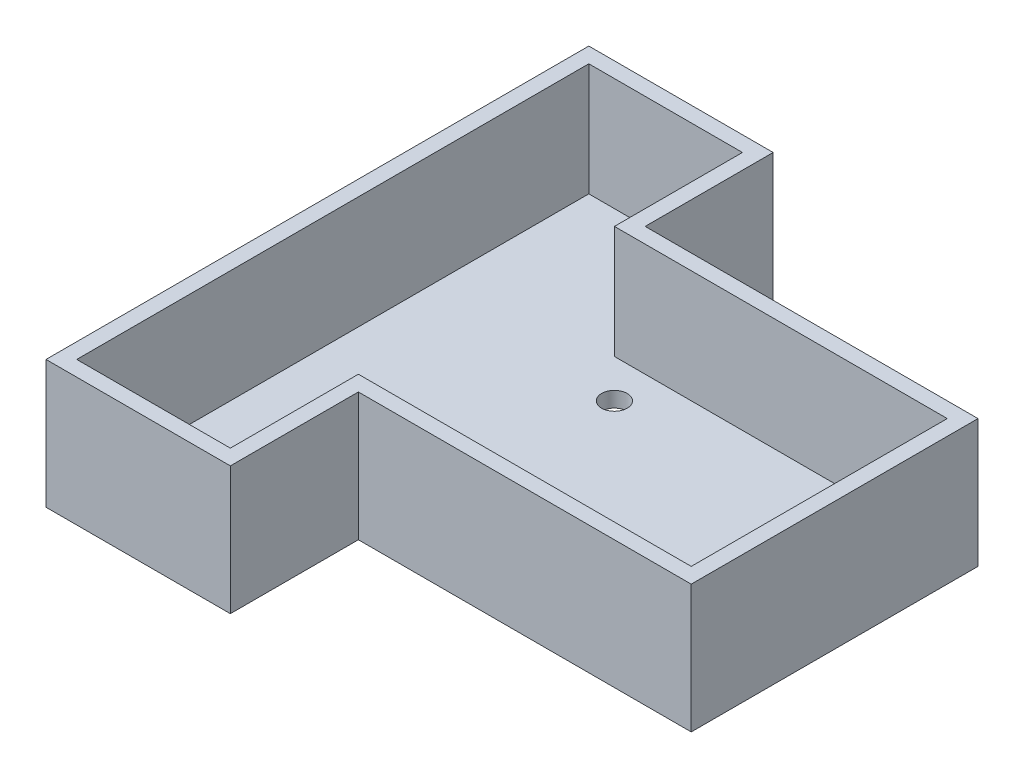
ISO-10303-21;
HEADER;
FILE_DESCRIPTION(('STEP AP214'),'2;1');
FILE_NAME('part.step','',(''),(''),'','','');
FILE_SCHEMA(('AUTOMOTIVE_DESIGN { 1 0 10303 214 1 1 1 1 }'));
ENDSEC;
DATA;
#1=APPLICATION_CONTEXT('core data for automotive mechanical design processes');
#2=APPLICATION_PROTOCOL_DEFINITION('international standard','automotive_design',2000,#1);
#3=PRODUCT_CONTEXT('',#1,'mechanical');
#4=PRODUCT('Part','Part','',(#3));
#5=PRODUCT_RELATED_PRODUCT_CATEGORY('part','',(#4));
#6=PRODUCT_DEFINITION_FORMATION('','',#4);
#7=PRODUCT_DEFINITION_CONTEXT('part definition',#1,'design');
#8=PRODUCT_DEFINITION('design','',#6,#7);
#9=PRODUCT_DEFINITION_SHAPE('','',#8);
#10=(LENGTH_UNIT() NAMED_UNIT(*) SI_UNIT(.MILLI.,.METRE.));
#11=(NAMED_UNIT(*) PLANE_ANGLE_UNIT() SI_UNIT($,.RADIAN.));
#12=(NAMED_UNIT(*) SI_UNIT($,.STERADIAN.) SOLID_ANGLE_UNIT());
#13=UNCERTAINTY_MEASURE_WITH_UNIT(LENGTH_MEASURE(1.E-05),#10,'distance_accuracy_value','');
#14=(GEOMETRIC_REPRESENTATION_CONTEXT(3) GLOBAL_UNCERTAINTY_ASSIGNED_CONTEXT((#13)) GLOBAL_UNIT_ASSIGNED_CONTEXT((#10,
#11,#12)) REPRESENTATION_CONTEXT('',''));
#15=CARTESIAN_POINT('',(0.,0.,0.));
#16=DIRECTION('',(0.,0.,1.));
#17=DIRECTION('',(1.,0.,0.));
#18=AXIS2_PLACEMENT_3D('',#15,#16,#17);
#19=CARTESIAN_POINT('',(-29.4999999999999,25.,0.));
#20=DIRECTION('',(1.,0.,0.));
#21=DIRECTION('',(0.,0.,-1.));
#22=AXIS2_PLACEMENT_3D('',#19,#20,#21);
#23=PLANE('',#22);
#24=DIRECTION('',(0.,0.,1.));
#25=VECTOR('',#24,1.);
#26=CARTESIAN_POINT('',(-29.4999999999999,0.,0.));
#27=LINE('',#26,#25);
#28=CARTESIAN_POINT('',(-29.4999999999999,0.,-53.));
#29=VERTEX_POINT('',#28);
#30=CARTESIAN_POINT('',(-29.4999999999999,0.,-28.));
#31=VERTEX_POINT('',#30);
#32=EDGE_CURVE('E157',#29,#31,#27,.T.);
#33=ORIENTED_EDGE('',*,*,#32,.F.);
#34=DIRECTION('',(0.,-1.,0.));
#35=VECTOR('',#34,1.);
#36=CARTESIAN_POINT('',(-29.4999999999999,25.,-53.));
#37=LINE('',#36,#35);
#38=CARTESIAN_POINT('',(-29.4999999999999,25.,-53.));
#39=VERTEX_POINT('',#38);
#40=EDGE_CURVE('E11',#39,#29,#37,.T.);
#41=ORIENTED_EDGE('',*,*,#40,.F.);
#42=DIRECTION('',(0.,0.,1.));
#43=VECTOR('',#42,1.);
#44=CARTESIAN_POINT('',(-29.4999999999999,25.,0.));
#45=LINE('',#44,#43);
#46=CARTESIAN_POINT('',(-29.4999999999999,25.,-28.));
#47=VERTEX_POINT('',#46);
#48=EDGE_CURVE('E200',#39,#47,#45,.T.);
#49=ORIENTED_EDGE('',*,*,#48,.T.);
#50=DIRECTION('',(0.,-1.,0.));
#51=VECTOR('',#50,1.);
#52=CARTESIAN_POINT('',(-29.4999999999999,25.,-28.));
#53=LINE('',#52,#51);
#54=EDGE_CURVE('E70',#47,#31,#53,.T.);
#55=ORIENTED_EDGE('',*,*,#54,.T.);
#56=EDGE_LOOP('',(#33,#41,#49,#55));
#57=FACE_BOUND('',#56,.T.);
#58=ADVANCED_FACE('F45',(#57),#23,.T.);
#59=CARTESIAN_POINT('',(0.,25.,-53.));
#60=DIRECTION('',(0.,0.,1.));
#61=DIRECTION('',(1.,0.,0.));
#62=AXIS2_PLACEMENT_3D('',#59,#60,#61);
#63=PLANE('',#62);
#64=DIRECTION('',(-1.,0.,0.));
#65=VECTOR('',#64,1.);
#66=CARTESIAN_POINT('',(0.,0.,-53.));
#67=LINE('',#66,#65);
#68=CARTESIAN_POINT('',(-65.5,0.,-53.));
#69=VERTEX_POINT('',#68);
#70=EDGE_CURVE('E160',#29,#69,#67,.T.);
#71=ORIENTED_EDGE('',*,*,#70,.T.);
#72=DIRECTION('',(0.,-1.,0.));
#73=VECTOR('',#72,1.);
#74=CARTESIAN_POINT('',(-65.5,25.,-53.));
#75=LINE('',#74,#73);
#76=CARTESIAN_POINT('',(-65.5,25.,-53.));
#77=VERTEX_POINT('',#76);
#78=EDGE_CURVE('E54',#77,#69,#75,.T.);
#79=ORIENTED_EDGE('',*,*,#78,.F.);
#80=DIRECTION('',(-1.,0.,0.));
#81=VECTOR('',#80,1.);
#82=CARTESIAN_POINT('',(0.,25.,-53.));
#83=LINE('',#82,#81);
#84=EDGE_CURVE('E239',#39,#77,#83,.T.);
#85=ORIENTED_EDGE('',*,*,#84,.F.);
#86=ORIENTED_EDGE('',*,*,#40,.T.);
#87=EDGE_LOOP('',(#71,#79,#85,#86));
#88=FACE_BOUND('',#87,.T.);
#89=ADVANCED_FACE('F424',(#88),#63,.F.);
#90=CARTESIAN_POINT('',(-65.5,25.,0.));
#91=DIRECTION('',(1.,0.,0.));
#92=DIRECTION('',(0.,0.,-1.));
#93=AXIS2_PLACEMENT_3D('',#90,#91,#92);
#94=PLANE('',#93);
#95=DIRECTION('',(0.,0.,1.));
#96=VECTOR('',#95,1.);
#97=CARTESIAN_POINT('',(-65.5,0.,0.));
#98=LINE('',#97,#96);
#99=CARTESIAN_POINT('',(-65.5,0.,53.));
#100=VERTEX_POINT('',#99);
#101=EDGE_CURVE('E164',#69,#100,#98,.T.);
#102=ORIENTED_EDGE('',*,*,#101,.T.);
#103=DIRECTION('',(0.,-1.,0.));
#104=VECTOR('',#103,1.);
#105=CARTESIAN_POINT('',(-65.5,25.,53.));
#106=LINE('',#105,#104);
#107=CARTESIAN_POINT('',(-65.5,25.,53.));
#108=VERTEX_POINT('',#107);
#109=EDGE_CURVE('E210',#108,#100,#106,.T.);
#110=ORIENTED_EDGE('',*,*,#109,.F.);
#111=DIRECTION('',(0.,0.,1.));
#112=VECTOR('',#111,1.);
#113=CARTESIAN_POINT('',(-65.5,25.,0.));
#114=LINE('',#113,#112);
#115=EDGE_CURVE('E222',#77,#108,#114,.T.);
#116=ORIENTED_EDGE('',*,*,#115,.F.);
#117=ORIENTED_EDGE('',*,*,#78,.T.);
#118=EDGE_LOOP('',(#102,#110,#116,#117));
#119=FACE_BOUND('',#118,.T.);
#120=ADVANCED_FACE('F220',(#119),#94,.F.);
#121=CARTESIAN_POINT('',(0.,25.,53.));
#122=DIRECTION('',(0.,0.,-1.));
#123=DIRECTION('',(-1.,0.,0.));
#124=AXIS2_PLACEMENT_3D('',#121,#122,#123);
#125=PLANE('',#124);
#126=DIRECTION('',(1.,0.,0.));
#127=VECTOR('',#126,1.);
#128=CARTESIAN_POINT('',(0.,0.,53.));
#129=LINE('',#128,#127);
#130=CARTESIAN_POINT('',(-29.5,0.,53.));
#131=VERTEX_POINT('',#130);
#132=EDGE_CURVE('E167',#100,#131,#129,.T.);
#133=ORIENTED_EDGE('',*,*,#132,.T.);
#134=DIRECTION('',(0.,-1.,0.));
#135=VECTOR('',#134,1.);
#136=CARTESIAN_POINT('',(-29.5,25.,53.));
#137=LINE('',#136,#135);
#138=CARTESIAN_POINT('',(-29.5,25.,53.));
#139=VERTEX_POINT('',#138);
#140=EDGE_CURVE('E207',#139,#131,#137,.T.);
#141=ORIENTED_EDGE('',*,*,#140,.F.);
#142=DIRECTION('',(1.,0.,0.));
#143=VECTOR('',#142,1.);
#144=CARTESIAN_POINT('',(0.,25.,53.));
#145=LINE('',#144,#143);
#146=EDGE_CURVE('E234',#108,#139,#145,.T.);
#147=ORIENTED_EDGE('',*,*,#146,.F.);
#148=ORIENTED_EDGE('',*,*,#109,.T.);
#149=EDGE_LOOP('',(#133,#141,#147,#148));
#150=FACE_BOUND('',#149,.T.);
#151=ADVANCED_FACE('F232',(#150),#125,.F.);
#152=CARTESIAN_POINT('',(-29.5,25.,0.));
#153=DIRECTION('',(1.,0.,0.));
#154=DIRECTION('',(0.,0.,-1.));
#155=AXIS2_PLACEMENT_3D('',#152,#153,#154);
#156=PLANE('',#155);
#157=DIRECTION('',(0.,0.,1.));
#158=VECTOR('',#157,1.);
#159=CARTESIAN_POINT('',(-29.5,0.,0.));
#160=LINE('',#159,#158);
#161=CARTESIAN_POINT('',(-29.5,0.,28.));
#162=VERTEX_POINT('',#161);
#163=EDGE_CURVE('E171',#162,#131,#160,.T.);
#164=ORIENTED_EDGE('',*,*,#163,.F.);
#165=DIRECTION('',(0.,-1.,0.));
#166=VECTOR('',#165,1.);
#167=CARTESIAN_POINT('',(-29.5,25.,28.));
#168=LINE('',#167,#166);
#169=CARTESIAN_POINT('',(-29.5,25.,28.));
#170=VERTEX_POINT('',#169);
#171=EDGE_CURVE('E135',#170,#162,#168,.T.);
#172=ORIENTED_EDGE('',*,*,#171,.F.);
#173=DIRECTION('',(0.,0.,1.));
#174=VECTOR('',#173,1.);
#175=CARTESIAN_POINT('',(-29.5,25.,0.));
#176=LINE('',#175,#174);
#177=EDGE_CURVE('E146',#170,#139,#176,.T.);
#178=ORIENTED_EDGE('',*,*,#177,.T.);
#179=ORIENTED_EDGE('',*,*,#140,.T.);
#180=EDGE_LOOP('',(#164,#172,#178,#179));
#181=FACE_BOUND('',#180,.T.);
#182=ADVANCED_FACE('F449',(#181),#156,.T.);
#183=CARTESIAN_POINT('',(0.,25.,28.));
#184=DIRECTION('',(0.,0.,1.));
#185=DIRECTION('',(1.,0.,0.));
#186=AXIS2_PLACEMENT_3D('',#183,#184,#185);
#187=PLANE('',#186);
#188=DIRECTION('',(-1.,0.,0.));
#189=VECTOR('',#188,1.);
#190=CARTESIAN_POINT('',(0.,0.,28.));
#191=LINE('',#190,#189);
#192=CARTESIAN_POINT('',(35.5000000000001,0.,28.));
#193=VERTEX_POINT('',#192);
#194=EDGE_CURVE('E129',#193,#162,#191,.T.);
#195=ORIENTED_EDGE('',*,*,#194,.F.);
#196=DIRECTION('',(0.,-1.,0.));
#197=VECTOR('',#196,1.);
#198=CARTESIAN_POINT('',(35.5000000000001,25.,28.));
#199=LINE('',#198,#197);
#200=CARTESIAN_POINT('',(35.5000000000001,25.,28.));
#201=VERTEX_POINT('',#200);
#202=EDGE_CURVE('E124',#201,#193,#199,.T.);
#203=ORIENTED_EDGE('',*,*,#202,.F.);
#204=DIRECTION('',(-1.,0.,0.));
#205=VECTOR('',#204,1.);
#206=CARTESIAN_POINT('',(0.,25.,28.));
#207=LINE('',#206,#205);
#208=EDGE_CURVE('E127',#201,#170,#207,.T.);
#209=ORIENTED_EDGE('',*,*,#208,.T.);
#210=ORIENTED_EDGE('',*,*,#171,.T.);
#211=EDGE_LOOP('',(#195,#203,#209,#210));
#212=FACE_BOUND('',#211,.T.);
#213=ADVANCED_FACE('F126',(#212),#187,.T.);
#214=CARTESIAN_POINT('',(35.5000000000001,25.,0.));
#215=DIRECTION('',(1.,0.,0.));
#216=DIRECTION('',(0.,0.,-1.));
#217=AXIS2_PLACEMENT_3D('',#214,#215,#216);
#218=PLANE('',#217);
#219=DIRECTION('',(0.,0.,1.));
#220=VECTOR('',#219,1.);
#221=CARTESIAN_POINT('',(35.5000000000001,0.,0.));
#222=LINE('',#221,#220);
#223=CARTESIAN_POINT('',(35.5000000000001,0.,-28.));
#224=VERTEX_POINT('',#223);
#225=EDGE_CURVE('E177',#224,#193,#222,.T.);
#226=ORIENTED_EDGE('',*,*,#225,.F.);
#227=DIRECTION('',(0.,-1.,0.));
#228=VECTOR('',#227,1.);
#229=CARTESIAN_POINT('',(35.5000000000001,25.,-28.));
#230=LINE('',#229,#228);
#231=CARTESIAN_POINT('',(35.5000000000001,25.,-28.));
#232=VERTEX_POINT('',#231);
#233=EDGE_CURVE('E136',#232,#224,#230,.T.);
#234=ORIENTED_EDGE('',*,*,#233,.F.);
#235=DIRECTION('',(0.,0.,1.));
#236=VECTOR('',#235,1.);
#237=CARTESIAN_POINT('',(35.5000000000001,25.,0.));
#238=LINE('',#237,#236);
#239=EDGE_CURVE('E144',#232,#201,#238,.T.);
#240=ORIENTED_EDGE('',*,*,#239,.T.);
#241=ORIENTED_EDGE('',*,*,#202,.T.);
#242=EDGE_LOOP('',(#226,#234,#240,#241));
#243=FACE_BOUND('',#242,.T.);
#244=ADVANCED_FACE('F149',(#243),#218,.T.);
#245=CARTESIAN_POINT('',(25.,25.,17.5));
#246=DIRECTION('',(0.,-1.,0.));
#247=DIRECTION('',(0.,0.,-1.));
#248=AXIS2_PLACEMENT_3D('',#245,#246,#247);
#249=CYLINDRICAL_SURFACE('',#248,2.5);
#250=CARTESIAN_POINT('',(25.,3.,17.5));
#251=DIRECTION('',(0.,-1.,0.));
#252=DIRECTION('',(0.,0.,-1.));
#253=AXIS2_PLACEMENT_3D('',#250,#251,#252);
#254=CIRCLE('',#253,2.5);
#255=CARTESIAN_POINT('',(25.,3.,15.));
#256=VERTEX_POINT('',#255);
#257=EDGE_CURVE('E161',#256,#256,#254,.T.);
#258=ORIENTED_EDGE('',*,*,#257,.F.);
#259=EDGE_LOOP('',(#258));
#260=FACE_BOUND('',#259,.T.);
#261=CARTESIAN_POINT('',(25.,0.,17.5));
#262=DIRECTION('',(0.,1.,0.));
#263=DIRECTION('',(0.,0.,1.));
#264=AXIS2_PLACEMENT_3D('',#261,#262,#263);
#265=CIRCLE('',#264,2.5);
#266=CARTESIAN_POINT('',(25.,0.,20.));
#267=VERTEX_POINT('',#266);
#268=EDGE_CURVE('E192',#267,#267,#265,.T.);
#269=ORIENTED_EDGE('',*,*,#268,.F.);
#270=EDGE_LOOP('',(#269));
#271=FACE_BOUND('',#270,.T.);
#272=ADVANCED_FACE('F446',(#260,#271),#249,.F.);
#273=CARTESIAN_POINT('',(-25.,25.,-17.5));
#274=DIRECTION('',(0.,-1.,0.));
#275=DIRECTION('',(0.,0.,-1.));
#276=AXIS2_PLACEMENT_3D('',#273,#274,#275);
#277=CYLINDRICAL_SURFACE('',#276,2.5);
#278=CARTESIAN_POINT('',(-25.,3.,-17.5));
#279=DIRECTION('',(0.,-1.,0.));
#280=DIRECTION('',(0.,0.,-1.));
#281=AXIS2_PLACEMENT_3D('',#278,#279,#280);
#282=CIRCLE('',#281,2.5);
#283=CARTESIAN_POINT('',(-25.,3.,-20.));
#284=VERTEX_POINT('',#283);
#285=EDGE_CURVE('E249',#284,#284,#282,.T.);
#286=ORIENTED_EDGE('',*,*,#285,.F.);
#287=EDGE_LOOP('',(#286));
#288=FACE_BOUND('',#287,.T.);
#289=CARTESIAN_POINT('',(-25.,0.,-17.5));
#290=DIRECTION('',(0.,1.,0.));
#291=DIRECTION('',(0.,0.,1.));
#292=AXIS2_PLACEMENT_3D('',#289,#290,#291);
#293=CIRCLE('',#292,2.5);
#294=CARTESIAN_POINT('',(-25.,0.,-15.));
#295=VERTEX_POINT('',#294);
#296=EDGE_CURVE('E188',#295,#295,#293,.T.);
#297=ORIENTED_EDGE('',*,*,#296,.F.);
#298=EDGE_LOOP('',(#297));
#299=FACE_BOUND('',#298,.T.);
#300=ADVANCED_FACE('F439',(#288,#299),#277,.F.);
#301=CARTESIAN_POINT('',(25.,25.,-17.5));
#302=DIRECTION('',(0.,-1.,0.));
#303=DIRECTION('',(0.,0.,-1.));
#304=AXIS2_PLACEMENT_3D('',#301,#302,#303);
#305=CYLINDRICAL_SURFACE('',#304,2.5);
#306=CARTESIAN_POINT('',(25.,3.,-17.5));
#307=DIRECTION('',(0.,-1.,0.));
#308=DIRECTION('',(0.,0.,-1.));
#309=AXIS2_PLACEMENT_3D('',#306,#307,#308);
#310=CIRCLE('',#309,2.5);
#311=CARTESIAN_POINT('',(25.,3.,-20.));
#312=VERTEX_POINT('',#311);
#313=EDGE_CURVE('E253',#312,#312,#310,.F.);
#314=ORIENTED_EDGE('',*,*,#313,.T.);
#315=EDGE_LOOP('',(#314));
#316=FACE_BOUND('',#315,.T.);
#317=CARTESIAN_POINT('',(25.,0.,-17.5));
#318=DIRECTION('',(0.,1.,0.));
#319=DIRECTION('',(0.,0.,1.));
#320=AXIS2_PLACEMENT_3D('',#317,#318,#319);
#321=CIRCLE('',#320,2.5);
#322=CARTESIAN_POINT('',(25.,0.,-15.));
#323=VERTEX_POINT('',#322);
#324=EDGE_CURVE('E184',#323,#323,#321,.F.);
#325=ORIENTED_EDGE('',*,*,#324,.T.);
#326=EDGE_LOOP('',(#325));
#327=FACE_BOUND('',#326,.T.);
#328=ADVANCED_FACE('F431',(#316,#327),#305,.F.);
#329=CARTESIAN_POINT('',(0.,25.,-28.));
#330=DIRECTION('',(0.,0.,-1.));
#331=DIRECTION('',(-1.,0.,0.));
#332=AXIS2_PLACEMENT_3D('',#329,#330,#331);
#333=PLANE('',#332);
#334=DIRECTION('',(1.,0.,0.));
#335=VECTOR('',#334,1.);
#336=CARTESIAN_POINT('',(0.,0.,-28.));
#337=LINE('',#336,#335);
#338=EDGE_CURVE('E180',#31,#224,#337,.T.);
#339=ORIENTED_EDGE('',*,*,#338,.F.);
#340=ORIENTED_EDGE('',*,*,#54,.F.);
#341=DIRECTION('',(1.,0.,0.));
#342=VECTOR('',#341,1.);
#343=CARTESIAN_POINT('',(0.,25.,-28.));
#344=LINE('',#343,#342);
#345=EDGE_CURVE('E151',#47,#232,#344,.T.);
#346=ORIENTED_EDGE('',*,*,#345,.T.);
#347=ORIENTED_EDGE('',*,*,#233,.T.);
#348=EDGE_LOOP('',(#339,#340,#346,#347));
#349=FACE_BOUND('',#348,.T.);
#350=ADVANCED_FACE('F428',(#349),#333,.T.);
#351=CARTESIAN_POINT('',(-25.,25.,17.5));
#352=DIRECTION('',(0.,-1.,0.));
#353=DIRECTION('',(0.,0.,-1.));
#354=AXIS2_PLACEMENT_3D('',#351,#352,#353);
#355=CYLINDRICAL_SURFACE('',#354,2.5);
#356=CARTESIAN_POINT('',(-25.,3.,17.5));
#357=DIRECTION('',(0.,-1.,0.));
#358=DIRECTION('',(0.,0.,-1.));
#359=AXIS2_PLACEMENT_3D('',#356,#357,#358);
#360=CIRCLE('',#359,2.5);
#361=CARTESIAN_POINT('',(-25.,3.,15.));
#362=VERTEX_POINT('',#361);
#363=EDGE_CURVE('E48',#362,#362,#360,.F.);
#364=ORIENTED_EDGE('',*,*,#363,.T.);
#365=EDGE_LOOP('',(#364));
#366=FACE_BOUND('',#365,.T.);
#367=CARTESIAN_POINT('',(-25.,0.,17.5));
#368=DIRECTION('',(0.,1.,0.));
#369=DIRECTION('',(0.,0.,1.));
#370=AXIS2_PLACEMENT_3D('',#367,#368,#369);
#371=CIRCLE('',#370,2.5);
#372=CARTESIAN_POINT('',(-25.,0.,20.));
#373=VERTEX_POINT('',#372);
#374=EDGE_CURVE('E196',#373,#373,#371,.F.);
#375=ORIENTED_EDGE('',*,*,#374,.T.);
#376=EDGE_LOOP('',(#375));
#377=FACE_BOUND('',#376,.T.);
#378=ADVANCED_FACE('F430',(#366,#377),#355,.F.);
#379=CARTESIAN_POINT('',(0.,25.,0.));
#380=DIRECTION('',(0.,1.,0.));
#381=DIRECTION('',(0.,0.,1.));
#382=AXIS2_PLACEMENT_3D('',#379,#380,#381);
#383=PLANE('',#382);
#384=DIRECTION('',(-1.,0.,0.));
#385=VECTOR('',#384,1.);
#386=CARTESIAN_POINT('',(32.5000000000001,25.,-25.));
#387=LINE('',#386,#385);
#388=CARTESIAN_POINT('',(32.5000000000001,25.,-25.));
#389=VERTEX_POINT('',#388);
#390=CARTESIAN_POINT('',(-32.4999999999999,25.,-25.));
#391=VERTEX_POINT('',#390);
#392=EDGE_CURVE('E61',#389,#391,#387,.T.);
#393=ORIENTED_EDGE('',*,*,#392,.F.);
#394=DIRECTION('',(0.,0.,-1.));
#395=VECTOR('',#394,1.);
#396=CARTESIAN_POINT('',(32.5000000000001,25.,25.));
#397=LINE('',#396,#395);
#398=CARTESIAN_POINT('',(32.5000000000001,25.,25.));
#399=VERTEX_POINT('',#398);
#400=EDGE_CURVE('E288',#399,#389,#397,.T.);
#401=ORIENTED_EDGE('',*,*,#400,.F.);
#402=DIRECTION('',(1.,0.,0.));
#403=VECTOR('',#402,1.);
#404=CARTESIAN_POINT('',(-32.5,25.,25.));
#405=LINE('',#404,#403);
#406=CARTESIAN_POINT('',(-32.5,25.,25.));
#407=VERTEX_POINT('',#406);
#408=EDGE_CURVE('E293',#407,#399,#405,.T.);
#409=ORIENTED_EDGE('',*,*,#408,.F.);
#410=DIRECTION('',(0.,0.,-1.));
#411=VECTOR('',#410,1.);
#412=CARTESIAN_POINT('',(-32.5,25.,50.));
#413=LINE('',#412,#411);
#414=CARTESIAN_POINT('',(-32.5,25.,50.));
#415=VERTEX_POINT('',#414);
#416=EDGE_CURVE('E297',#415,#407,#413,.T.);
#417=ORIENTED_EDGE('',*,*,#416,.F.);
#418=DIRECTION('',(1.,0.,0.));
#419=VECTOR('',#418,1.);
#420=CARTESIAN_POINT('',(-62.5,25.,50.));
#421=LINE('',#420,#419);
#422=CARTESIAN_POINT('',(-62.5,25.,50.));
#423=VERTEX_POINT('',#422);
#424=EDGE_CURVE('E301',#423,#415,#421,.T.);
#425=ORIENTED_EDGE('',*,*,#424,.F.);
#426=DIRECTION('',(0.,0.,1.));
#427=VECTOR('',#426,1.);
#428=CARTESIAN_POINT('',(-62.5,25.,-50.));
#429=LINE('',#428,#427);
#430=CARTESIAN_POINT('',(-62.5,25.,-50.));
#431=VERTEX_POINT('',#430);
#432=EDGE_CURVE('E305',#431,#423,#429,.T.);
#433=ORIENTED_EDGE('',*,*,#432,.F.);
#434=DIRECTION('',(-1.,0.,0.));
#435=VECTOR('',#434,1.);
#436=CARTESIAN_POINT('',(-32.4999999999999,25.,-50.));
#437=LINE('',#436,#435);
#438=CARTESIAN_POINT('',(-32.4999999999999,25.,-50.));
#439=VERTEX_POINT('',#438);
#440=EDGE_CURVE('E309',#439,#431,#437,.T.);
#441=ORIENTED_EDGE('',*,*,#440,.F.);
#442=DIRECTION('',(0.,0.,-1.));
#443=VECTOR('',#442,1.);
#444=CARTESIAN_POINT('',(-32.4999999999999,25.,-25.));
#445=LINE('',#444,#443);
#446=EDGE_CURVE('E313',#391,#439,#445,.T.);
#447=ORIENTED_EDGE('',*,*,#446,.F.);
#448=EDGE_LOOP('',(#393,#401,#409,#417,#425,#433,#441,#447));
#449=FACE_BOUND('',#448,.T.);
#450=ORIENTED_EDGE('',*,*,#48,.F.);
#451=ORIENTED_EDGE('',*,*,#84,.T.);
#452=ORIENTED_EDGE('',*,*,#115,.T.);
#453=ORIENTED_EDGE('',*,*,#146,.T.);
#454=ORIENTED_EDGE('',*,*,#177,.F.);
#455=ORIENTED_EDGE('',*,*,#208,.F.);
#456=ORIENTED_EDGE('',*,*,#239,.F.);
#457=ORIENTED_EDGE('',*,*,#345,.F.);
#458=EDGE_LOOP('',(#450,#451,#452,#453,#454,#455,#456,#457));
#459=FACE_BOUND('',#458,.T.);
#460=ADVANCED_FACE('F142',(#449,#459),#383,.T.);
#461=CARTESIAN_POINT('',(0.,0.,0.));
#462=DIRECTION('',(0.,1.,0.));
#463=DIRECTION('',(0.,0.,1.));
#464=AXIS2_PLACEMENT_3D('',#461,#462,#463);
#465=PLANE('',#464);
#466=ORIENTED_EDGE('',*,*,#32,.T.);
#467=ORIENTED_EDGE('',*,*,#338,.T.);
#468=ORIENTED_EDGE('',*,*,#225,.T.);
#469=ORIENTED_EDGE('',*,*,#194,.T.);
#470=ORIENTED_EDGE('',*,*,#163,.T.);
#471=ORIENTED_EDGE('',*,*,#132,.F.);
#472=ORIENTED_EDGE('',*,*,#101,.F.);
#473=ORIENTED_EDGE('',*,*,#70,.F.);
#474=EDGE_LOOP('',(#466,#467,#468,#469,#470,#471,#472,#473));
#475=FACE_BOUND('',#474,.T.);
#476=ORIENTED_EDGE('',*,*,#324,.F.);
#477=EDGE_LOOP('',(#476));
#478=FACE_BOUND('',#477,.T.);
#479=ORIENTED_EDGE('',*,*,#296,.T.);
#480=EDGE_LOOP('',(#479));
#481=FACE_BOUND('',#480,.T.);
#482=ORIENTED_EDGE('',*,*,#268,.T.);
#483=EDGE_LOOP('',(#482));
#484=FACE_BOUND('',#483,.T.);
#485=ORIENTED_EDGE('',*,*,#374,.F.);
#486=EDGE_LOOP('',(#485));
#487=FACE_BOUND('',#486,.T.);
#488=ADVANCED_FACE('F227',(#475,#478,#481,#484,#487),#465,.F.);
#489=CARTESIAN_POINT('',(0.,3.,0.));
#490=DIRECTION('',(0.,-1.,0.));
#491=DIRECTION('',(0.,0.,-1.));
#492=AXIS2_PLACEMENT_3D('',#489,#490,#491);
#493=PLANE('',#492);
#494=ORIENTED_EDGE('',*,*,#257,.T.);
#495=EDGE_LOOP('',(#494));
#496=FACE_BOUND('',#495,.T.);
#497=ORIENTED_EDGE('',*,*,#285,.T.);
#498=EDGE_LOOP('',(#497));
#499=FACE_BOUND('',#498,.T.);
#500=ORIENTED_EDGE('',*,*,#363,.F.);
#501=EDGE_LOOP('',(#500));
#502=FACE_BOUND('',#501,.T.);
#503=DIRECTION('',(-1.,0.,0.));
#504=VECTOR('',#503,1.);
#505=CARTESIAN_POINT('',(32.5000000000001,3.,-25.));
#506=LINE('',#505,#504);
#507=CARTESIAN_POINT('',(32.5000000000001,3.,-25.));
#508=VERTEX_POINT('',#507);
#509=CARTESIAN_POINT('',(-32.4999999999999,3.,-25.));
#510=VERTEX_POINT('',#509);
#511=EDGE_CURVE('E292',#508,#510,#506,.T.);
#512=ORIENTED_EDGE('',*,*,#511,.T.);
#513=DIRECTION('',(0.,0.,-1.));
#514=VECTOR('',#513,1.);
#515=CARTESIAN_POINT('',(-32.4999999999999,3.,-25.));
#516=LINE('',#515,#514);
#517=CARTESIAN_POINT('',(-32.4999999999999,3.,-50.));
#518=VERTEX_POINT('',#517);
#519=EDGE_CURVE('E342',#510,#518,#516,.T.);
#520=ORIENTED_EDGE('',*,*,#519,.T.);
#521=DIRECTION('',(-1.,0.,0.));
#522=VECTOR('',#521,1.);
#523=CARTESIAN_POINT('',(-32.4999999999999,3.,-50.));
#524=LINE('',#523,#522);
#525=CARTESIAN_POINT('',(-62.5,3.,-50.));
#526=VERTEX_POINT('',#525);
#527=EDGE_CURVE('E338',#518,#526,#524,.T.);
#528=ORIENTED_EDGE('',*,*,#527,.T.);
#529=DIRECTION('',(0.,0.,1.));
#530=VECTOR('',#529,1.);
#531=CARTESIAN_POINT('',(-62.5,3.,-50.));
#532=LINE('',#531,#530);
#533=CARTESIAN_POINT('',(-62.5,3.,50.));
#534=VERTEX_POINT('',#533);
#535=EDGE_CURVE('E334',#526,#534,#532,.T.);
#536=ORIENTED_EDGE('',*,*,#535,.T.);
#537=DIRECTION('',(1.,0.,0.));
#538=VECTOR('',#537,1.);
#539=CARTESIAN_POINT('',(-62.5,3.,50.));
#540=LINE('',#539,#538);
#541=CARTESIAN_POINT('',(-32.5,3.,50.));
#542=VERTEX_POINT('',#541);
#543=EDGE_CURVE('E330',#534,#542,#540,.T.);
#544=ORIENTED_EDGE('',*,*,#543,.T.);
#545=DIRECTION('',(0.,0.,-1.));
#546=VECTOR('',#545,1.);
#547=CARTESIAN_POINT('',(-32.5,3.,50.));
#548=LINE('',#547,#546);
#549=CARTESIAN_POINT('',(-32.5,3.,25.));
#550=VERTEX_POINT('',#549);
#551=EDGE_CURVE('E326',#542,#550,#548,.T.);
#552=ORIENTED_EDGE('',*,*,#551,.T.);
#553=DIRECTION('',(1.,0.,0.));
#554=VECTOR('',#553,1.);
#555=CARTESIAN_POINT('',(-32.5,3.,25.));
#556=LINE('',#555,#554);
#557=CARTESIAN_POINT('',(32.5000000000001,3.,25.));
#558=VERTEX_POINT('',#557);
#559=EDGE_CURVE('E322',#550,#558,#556,.T.);
#560=ORIENTED_EDGE('',*,*,#559,.T.);
#561=DIRECTION('',(0.,0.,-1.));
#562=VECTOR('',#561,1.);
#563=CARTESIAN_POINT('',(32.5000000000001,3.,25.));
#564=LINE('',#563,#562);
#565=EDGE_CURVE('E261',#558,#508,#564,.T.);
#566=ORIENTED_EDGE('',*,*,#565,.T.);
#567=EDGE_LOOP('',(#512,#520,#528,#536,#544,#552,#560,#566));
#568=FACE_BOUND('',#567,.T.);
#569=ORIENTED_EDGE('',*,*,#313,.F.);
#570=EDGE_LOOP('',(#569));
#571=FACE_BOUND('',#570,.T.);
#572=ADVANCED_FACE('F351',(#496,#499,#502,#568,#571),#493,.F.);
#573=CARTESIAN_POINT('',(32.5000000000001,3.,-25.));
#574=DIRECTION('',(0.,0.,-1.));
#575=DIRECTION('',(-1.,0.,0.));
#576=AXIS2_PLACEMENT_3D('',#573,#574,#575);
#577=PLANE('',#576);
#578=ORIENTED_EDGE('',*,*,#392,.T.);
#579=DIRECTION('',(0.,1.,0.));
#580=VECTOR('',#579,1.);
#581=CARTESIAN_POINT('',(-32.4999999999999,3.,-25.));
#582=LINE('',#581,#580);
#583=EDGE_CURVE('E257',#510,#391,#582,.T.);
#584=ORIENTED_EDGE('',*,*,#583,.F.);
#585=ORIENTED_EDGE('',*,*,#511,.F.);
#586=DIRECTION('',(0.,1.,0.));
#587=VECTOR('',#586,1.);
#588=CARTESIAN_POINT('',(32.5000000000001,3.,-25.));
#589=LINE('',#588,#587);
#590=EDGE_CURVE('E285',#508,#389,#589,.T.);
#591=ORIENTED_EDGE('',*,*,#590,.T.);
#592=EDGE_LOOP('',(#578,#584,#585,#591));
#593=FACE_BOUND('',#592,.T.);
#594=ADVANCED_FACE('F357',(#593),#577,.F.);
#595=CARTESIAN_POINT('',(32.5000000000001,3.,25.));
#596=DIRECTION('',(1.,0.,0.));
#597=DIRECTION('',(0.,0.,-1.));
#598=AXIS2_PLACEMENT_3D('',#595,#596,#597);
#599=PLANE('',#598);
#600=ORIENTED_EDGE('',*,*,#400,.T.);
#601=ORIENTED_EDGE('',*,*,#590,.F.);
#602=ORIENTED_EDGE('',*,*,#565,.F.);
#603=DIRECTION('',(0.,1.,0.));
#604=VECTOR('',#603,1.);
#605=CARTESIAN_POINT('',(32.5000000000001,3.,25.));
#606=LINE('',#605,#604);
#607=EDGE_CURVE('E281',#558,#399,#606,.T.);
#608=ORIENTED_EDGE('',*,*,#607,.T.);
#609=EDGE_LOOP('',(#600,#601,#602,#608));
#610=FACE_BOUND('',#609,.T.);
#611=ADVANCED_FACE('F377',(#610),#599,.F.);
#612=CARTESIAN_POINT('',(-32.5,3.,25.));
#613=DIRECTION('',(0.,0.,1.));
#614=DIRECTION('',(1.,0.,0.));
#615=AXIS2_PLACEMENT_3D('',#612,#613,#614);
#616=PLANE('',#615);
#617=ORIENTED_EDGE('',*,*,#408,.T.);
#618=ORIENTED_EDGE('',*,*,#607,.F.);
#619=ORIENTED_EDGE('',*,*,#559,.F.);
#620=DIRECTION('',(0.,1.,0.));
#621=VECTOR('',#620,1.);
#622=CARTESIAN_POINT('',(-32.5,3.,25.));
#623=LINE('',#622,#621);
#624=EDGE_CURVE('E277',#550,#407,#623,.T.);
#625=ORIENTED_EDGE('',*,*,#624,.T.);
#626=EDGE_LOOP('',(#617,#618,#619,#625));
#627=FACE_BOUND('',#626,.T.);
#628=ADVANCED_FACE('F382',(#627),#616,.F.);
#629=CARTESIAN_POINT('',(-32.5,3.,50.));
#630=DIRECTION('',(1.,0.,0.));
#631=DIRECTION('',(0.,0.,-1.));
#632=AXIS2_PLACEMENT_3D('',#629,#630,#631);
#633=PLANE('',#632);
#634=ORIENTED_EDGE('',*,*,#416,.T.);
#635=ORIENTED_EDGE('',*,*,#624,.F.);
#636=ORIENTED_EDGE('',*,*,#551,.F.);
#637=DIRECTION('',(0.,1.,0.));
#638=VECTOR('',#637,1.);
#639=CARTESIAN_POINT('',(-32.5,3.,50.));
#640=LINE('',#639,#638);
#641=EDGE_CURVE('E273',#542,#415,#640,.T.);
#642=ORIENTED_EDGE('',*,*,#641,.T.);
#643=EDGE_LOOP('',(#634,#635,#636,#642));
#644=FACE_BOUND('',#643,.T.);
#645=ADVANCED_FACE('F408',(#644),#633,.F.);
#646=CARTESIAN_POINT('',(-62.5,3.,50.));
#647=DIRECTION('',(0.,0.,1.));
#648=DIRECTION('',(1.,0.,0.));
#649=AXIS2_PLACEMENT_3D('',#646,#647,#648);
#650=PLANE('',#649);
#651=ORIENTED_EDGE('',*,*,#424,.T.);
#652=ORIENTED_EDGE('',*,*,#641,.F.);
#653=ORIENTED_EDGE('',*,*,#543,.F.);
#654=DIRECTION('',(0.,1.,0.));
#655=VECTOR('',#654,1.);
#656=CARTESIAN_POINT('',(-62.5,3.,50.));
#657=LINE('',#656,#655);
#658=EDGE_CURVE('E269',#534,#423,#657,.T.);
#659=ORIENTED_EDGE('',*,*,#658,.T.);
#660=EDGE_LOOP('',(#651,#652,#653,#659));
#661=FACE_BOUND('',#660,.T.);
#662=ADVANCED_FACE('F411',(#661),#650,.F.);
#663=CARTESIAN_POINT('',(-62.5,3.,-50.));
#664=DIRECTION('',(-1.,0.,0.));
#665=DIRECTION('',(0.,0.,1.));
#666=AXIS2_PLACEMENT_3D('',#663,#664,#665);
#667=PLANE('',#666);
#668=ORIENTED_EDGE('',*,*,#432,.T.);
#669=ORIENTED_EDGE('',*,*,#658,.F.);
#670=ORIENTED_EDGE('',*,*,#535,.F.);
#671=DIRECTION('',(0.,1.,0.));
#672=VECTOR('',#671,1.);
#673=CARTESIAN_POINT('',(-62.5,3.,-50.));
#674=LINE('',#673,#672);
#675=EDGE_CURVE('E265',#526,#431,#674,.T.);
#676=ORIENTED_EDGE('',*,*,#675,.T.);
#677=EDGE_LOOP('',(#668,#669,#670,#676));
#678=FACE_BOUND('',#677,.T.);
#679=ADVANCED_FACE('F414',(#678),#667,.F.);
#680=CARTESIAN_POINT('',(-32.4999999999999,3.,-50.));
#681=DIRECTION('',(0.,0.,-1.));
#682=DIRECTION('',(-1.,0.,0.));
#683=AXIS2_PLACEMENT_3D('',#680,#681,#682);
#684=PLANE('',#683);
#685=ORIENTED_EDGE('',*,*,#440,.T.);
#686=ORIENTED_EDGE('',*,*,#675,.F.);
#687=ORIENTED_EDGE('',*,*,#527,.F.);
#688=DIRECTION('',(0.,1.,0.));
#689=VECTOR('',#688,1.);
#690=CARTESIAN_POINT('',(-32.4999999999999,3.,-50.));
#691=LINE('',#690,#689);
#692=EDGE_CURVE('E260',#518,#439,#691,.T.);
#693=ORIENTED_EDGE('',*,*,#692,.T.);
#694=EDGE_LOOP('',(#685,#686,#687,#693));
#695=FACE_BOUND('',#694,.T.);
#696=ADVANCED_FACE('F397',(#695),#684,.F.);
#697=CARTESIAN_POINT('',(-32.4999999999999,3.,-25.));
#698=DIRECTION('',(1.,0.,0.));
#699=DIRECTION('',(0.,0.,-1.));
#700=AXIS2_PLACEMENT_3D('',#697,#698,#699);
#701=PLANE('',#700);
#702=ORIENTED_EDGE('',*,*,#446,.T.);
#703=ORIENTED_EDGE('',*,*,#692,.F.);
#704=ORIENTED_EDGE('',*,*,#519,.F.);
#705=ORIENTED_EDGE('',*,*,#583,.T.);
#706=EDGE_LOOP('',(#702,#703,#704,#705));
#707=FACE_BOUND('',#706,.T.);
#708=ADVANCED_FACE('F391',(#707),#701,.F.);
#709=CLOSED_SHELL('',(#58,#89,#120,#151,#182,#213,#244,#272,#300,#328,#350,#378,#460,#488,#572,
#594,#611,#628,#645,#662,#679,#696,#708));
#710=MANIFOLD_SOLID_BREP('B2',#709);
#711=ADVANCED_BREP_SHAPE_REPRESENTATION('',(#18,#710),#14);
#712=SHAPE_DEFINITION_REPRESENTATION(#9,#711);
ENDSEC;
END-ISO-10303-21;
